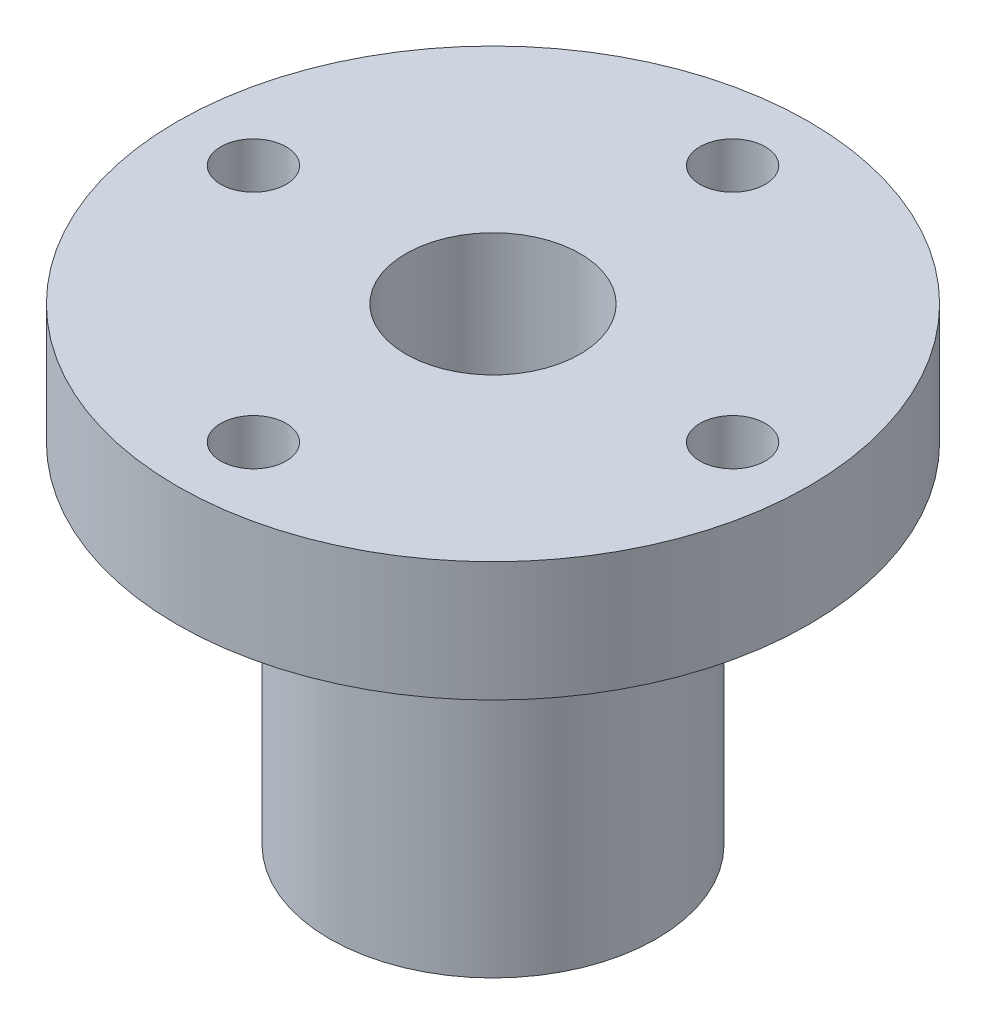
ISO-10303-21;
HEADER;
FILE_DESCRIPTION(('STEP AP214'),'2;1');
FILE_NAME('part.step','',(''),(''),'','','');
FILE_SCHEMA(('AUTOMOTIVE_DESIGN { 1 0 10303 214 1 1 1 1 }'));
ENDSEC;
DATA;
#1=APPLICATION_CONTEXT('core data for automotive mechanical design processes');
#2=APPLICATION_PROTOCOL_DEFINITION('international standard','automotive_design',2000,#1);
#3=PRODUCT_CONTEXT('',#1,'mechanical');
#4=PRODUCT('Part','Part','',(#3));
#5=PRODUCT_RELATED_PRODUCT_CATEGORY('part','',(#4));
#6=PRODUCT_DEFINITION_FORMATION('','',#4);
#7=PRODUCT_DEFINITION_CONTEXT('part definition',#1,'design');
#8=PRODUCT_DEFINITION('design','',#6,#7);
#9=PRODUCT_DEFINITION_SHAPE('','',#8);
#10=(LENGTH_UNIT() NAMED_UNIT(*) SI_UNIT(.MILLI.,.METRE.));
#11=(NAMED_UNIT(*) PLANE_ANGLE_UNIT() SI_UNIT($,.RADIAN.));
#12=(NAMED_UNIT(*) SI_UNIT($,.STERADIAN.) SOLID_ANGLE_UNIT());
#13=UNCERTAINTY_MEASURE_WITH_UNIT(LENGTH_MEASURE(1.E-05),#10,'distance_accuracy_value','');
#14=(GEOMETRIC_REPRESENTATION_CONTEXT(3) GLOBAL_UNCERTAINTY_ASSIGNED_CONTEXT((#13)) GLOBAL_UNIT_ASSIGNED_CONTEXT((#10,
#11,#12)) REPRESENTATION_CONTEXT('',''));
#15=CARTESIAN_POINT('',(0.,0.,0.));
#16=DIRECTION('',(0.,0.,1.));
#17=DIRECTION('',(1.,0.,0.));
#18=AXIS2_PLACEMENT_3D('',#15,#16,#17);
#19=CARTESIAN_POINT('',(0.,16.,0.));
#20=DIRECTION('',(0.,-1.,0.));
#21=DIRECTION('',(0.,0.,-1.));
#22=AXIS2_PLACEMENT_3D('',#19,#20,#21);
#23=CYLINDRICAL_SURFACE('',#22,7.5);
#24=CARTESIAN_POINT('',(0.,0.,0.));
#25=DIRECTION('',(0.,1.,0.));
#26=DIRECTION('',(0.,0.,1.));
#27=AXIS2_PLACEMENT_3D('',#24,#25,#26);
#28=CIRCLE('',#27,7.5);
#29=CARTESIAN_POINT('',(0.,0.,7.5));
#30=VERTEX_POINT('',#29);
#31=EDGE_CURVE('E49',#30,#30,#28,.T.);
#32=ORIENTED_EDGE('',*,*,#31,.T.);
#33=EDGE_LOOP('',(#32));
#34=FACE_BOUND('',#33,.T.);
#35=CARTESIAN_POINT('',(0.,16.,0.));
#36=DIRECTION('',(0.,1.,0.));
#37=DIRECTION('',(0.,0.,1.));
#38=AXIS2_PLACEMENT_3D('',#35,#36,#37);
#39=CIRCLE('',#38,7.5);
#40=CARTESIAN_POINT('',(0.,16.,7.5));
#41=VERTEX_POINT('',#40);
#42=EDGE_CURVE('E10',#41,#41,#39,.T.);
#43=ORIENTED_EDGE('',*,*,#42,.F.);
#44=EDGE_LOOP('',(#43));
#45=FACE_BOUND('',#44,.T.);
#46=ADVANCED_FACE('F43',(#34,#45),#23,.T.);
#47=CARTESIAN_POINT('',(0.,0.,0.));
#48=DIRECTION('',(0.,1.,0.));
#49=DIRECTION('',(0.,0.,1.));
#50=AXIS2_PLACEMENT_3D('',#47,#48,#49);
#51=PLANE('',#50);
#52=ORIENTED_EDGE('',*,*,#31,.F.);
#53=EDGE_LOOP('',(#52));
#54=FACE_BOUND('',#53,.T.);
#55=CARTESIAN_POINT('',(0.,0.,0.));
#56=DIRECTION('',(0.,1.,0.));
#57=DIRECTION('',(0.,0.,1.));
#58=AXIS2_PLACEMENT_3D('',#55,#56,#57);
#59=CIRCLE('',#58,4.);
#60=CARTESIAN_POINT('',(0.,0.,4.));
#61=VERTEX_POINT('',#60);
#62=EDGE_CURVE('E53',#61,#61,#59,.T.);
#63=ORIENTED_EDGE('',*,*,#62,.T.);
#64=EDGE_LOOP('',(#63));
#65=FACE_BOUND('',#64,.T.);
#66=ADVANCED_FACE('F134',(#54,#65),#51,.F.);
#67=CARTESIAN_POINT('',(0.,16.,0.));
#68=DIRECTION('',(0.,-1.,0.));
#69=DIRECTION('',(0.,0.,-1.));
#70=AXIS2_PLACEMENT_3D('',#67,#68,#69);
#71=CYLINDRICAL_SURFACE('',#70,4.);
#72=ORIENTED_EDGE('',*,*,#62,.F.);
#73=EDGE_LOOP('',(#72));
#74=FACE_BOUND('',#73,.T.);
#75=CARTESIAN_POINT('',(0.,21.5,0.));
#76=DIRECTION('',(0.,1.,0.));
#77=DIRECTION('',(0.,0.,1.));
#78=AXIS2_PLACEMENT_3D('',#75,#76,#77);
#79=CIRCLE('',#78,4.);
#80=CARTESIAN_POINT('',(0.,21.5,4.));
#81=VERTEX_POINT('',#80);
#82=EDGE_CURVE('E57',#81,#81,#79,.T.);
#83=ORIENTED_EDGE('',*,*,#82,.T.);
#84=EDGE_LOOP('',(#83));
#85=FACE_BOUND('',#84,.T.);
#86=ADVANCED_FACE('F107',(#74,#85),#71,.F.);
#87=CARTESIAN_POINT('',(0.,21.5,0.));
#88=DIRECTION('',(0.,1.,0.));
#89=DIRECTION('',(0.,0.,1.));
#90=AXIS2_PLACEMENT_3D('',#87,#88,#89);
#91=PLANE('',#90);
#92=CARTESIAN_POINT('',(11.0000000000003,21.5,-3.10618136515851E-13));
#93=DIRECTION('',(0.,1.,0.));
#94=DIRECTION('',(0.,0.,1.));
#95=AXIS2_PLACEMENT_3D('',#92,#93,#94);
#96=CIRCLE('',#95,1.50000000000024);
#97=CARTESIAN_POINT('',(11.0000000000003,21.5,1.49999999999993));
#98=VERTEX_POINT('',#97);
#99=EDGE_CURVE('E87',#98,#98,#96,.T.);
#100=ORIENTED_EDGE('',*,*,#99,.F.);
#101=EDGE_LOOP('',(#100));
#102=FACE_BOUND('',#101,.T.);
#103=CARTESIAN_POINT('',(0.,21.5,11.));
#104=DIRECTION('',(0.,1.,0.));
#105=DIRECTION('',(0.,0.,1.));
#106=AXIS2_PLACEMENT_3D('',#103,#104,#105);
#107=CIRCLE('',#106,1.5);
#108=CARTESIAN_POINT('',(0.,21.5,12.5));
#109=VERTEX_POINT('',#108);
#110=EDGE_CURVE('E81',#109,#109,#107,.T.);
#111=ORIENTED_EDGE('',*,*,#110,.F.);
#112=EDGE_LOOP('',(#111));
#113=FACE_BOUND('',#112,.T.);
#114=CARTESIAN_POINT('',(-10.9999999999997,21.5,3.11965247994913E-13));
#115=DIRECTION('',(0.,1.,0.));
#116=DIRECTION('',(0.,0.,1.));
#117=AXIS2_PLACEMENT_3D('',#114,#115,#116);
#118=CIRCLE('',#117,1.5000000000005);
#119=CARTESIAN_POINT('',(-10.9999999999997,21.5,1.50000000000081));
#120=VERTEX_POINT('',#119);
#121=EDGE_CURVE('E75',#120,#120,#118,.T.);
#122=ORIENTED_EDGE('',*,*,#121,.F.);
#123=EDGE_LOOP('',(#122));
#124=FACE_BOUND('',#123,.T.);
#125=CARTESIAN_POINT('',(0.,21.5,-11.));
#126=DIRECTION('',(0.,1.,0.));
#127=DIRECTION('',(0.,0.,1.));
#128=AXIS2_PLACEMENT_3D('',#125,#126,#127);
#129=CIRCLE('',#128,1.5);
#130=CARTESIAN_POINT('',(0.,21.5,-9.5));
#131=VERTEX_POINT('',#130);
#132=EDGE_CURVE('E69',#131,#131,#129,.T.);
#133=ORIENTED_EDGE('',*,*,#132,.F.);
#134=EDGE_LOOP('',(#133));
#135=FACE_BOUND('',#134,.T.);
#136=ORIENTED_EDGE('',*,*,#82,.F.);
#137=EDGE_LOOP('',(#136));
#138=FACE_BOUND('',#137,.T.);
#139=CARTESIAN_POINT('',(0.,21.5,0.));
#140=DIRECTION('',(0.,1.,0.));
#141=DIRECTION('',(0.,0.,1.));
#142=AXIS2_PLACEMENT_3D('',#139,#140,#141);
#143=CIRCLE('',#142,14.5);
#144=CARTESIAN_POINT('',(0.,21.5,14.5));
#145=VERTEX_POINT('',#144);
#146=EDGE_CURVE('E62',#145,#145,#143,.T.);
#147=ORIENTED_EDGE('',*,*,#146,.T.);
#148=EDGE_LOOP('',(#147));
#149=FACE_BOUND('',#148,.T.);
#150=ADVANCED_FACE('F103',(#102,#113,#124,#135,#138,#149),#91,.T.);
#151=CARTESIAN_POINT('',(0.,21.5,0.));
#152=DIRECTION('',(0.,-1.,0.));
#153=DIRECTION('',(0.,0.,-1.));
#154=AXIS2_PLACEMENT_3D('',#151,#152,#153);
#155=CYLINDRICAL_SURFACE('',#154,14.5);
#156=ORIENTED_EDGE('',*,*,#146,.F.);
#157=EDGE_LOOP('',(#156));
#158=FACE_BOUND('',#157,.T.);
#159=CARTESIAN_POINT('',(0.,16.,0.));
#160=DIRECTION('',(0.,1.,0.));
#161=DIRECTION('',(0.,0.,1.));
#162=AXIS2_PLACEMENT_3D('',#159,#160,#161);
#163=CIRCLE('',#162,14.5);
#164=CARTESIAN_POINT('',(0.,16.,14.5));
#165=VERTEX_POINT('',#164);
#166=EDGE_CURVE('E63',#165,#165,#163,.T.);
#167=ORIENTED_EDGE('',*,*,#166,.T.);
#168=EDGE_LOOP('',(#167));
#169=FACE_BOUND('',#168,.T.);
#170=ADVANCED_FACE('F106',(#158,#169),#155,.T.);
#171=CARTESIAN_POINT('',(0.,16.,0.));
#172=DIRECTION('',(0.,1.,0.));
#173=DIRECTION('',(0.,0.,1.));
#174=AXIS2_PLACEMENT_3D('',#171,#172,#173);
#175=PLANE('',#174);
#176=CARTESIAN_POINT('',(11.0000000000003,16.,-3.10618136515851E-13));
#177=DIRECTION('',(0.,1.,0.));
#178=DIRECTION('',(0.,0.,1.));
#179=AXIS2_PLACEMENT_3D('',#176,#177,#178);
#180=CIRCLE('',#179,1.50000000000024);
#181=CARTESIAN_POINT('',(11.0000000000003,16.,1.49999999999993));
#182=VERTEX_POINT('',#181);
#183=EDGE_CURVE('E66',#182,#182,#180,.T.);
#184=ORIENTED_EDGE('',*,*,#183,.T.);
#185=EDGE_LOOP('',(#184));
#186=FACE_BOUND('',#185,.T.);
#187=CARTESIAN_POINT('',(0.,16.,11.));
#188=DIRECTION('',(0.,1.,0.));
#189=DIRECTION('',(0.,0.,1.));
#190=AXIS2_PLACEMENT_3D('',#187,#188,#189);
#191=CIRCLE('',#190,1.5);
#192=CARTESIAN_POINT('',(0.,16.,12.5));
#193=VERTEX_POINT('',#192);
#194=EDGE_CURVE('E84',#193,#193,#191,.T.);
#195=ORIENTED_EDGE('',*,*,#194,.T.);
#196=EDGE_LOOP('',(#195));
#197=FACE_BOUND('',#196,.T.);
#198=CARTESIAN_POINT('',(-10.9999999999997,16.,3.11965247994913E-13));
#199=DIRECTION('',(0.,1.,0.));
#200=DIRECTION('',(0.,0.,1.));
#201=AXIS2_PLACEMENT_3D('',#198,#199,#200);
#202=CIRCLE('',#201,1.5000000000005);
#203=CARTESIAN_POINT('',(-10.9999999999997,16.,1.50000000000081));
#204=VERTEX_POINT('',#203);
#205=EDGE_CURVE('E78',#204,#204,#202,.T.);
#206=ORIENTED_EDGE('',*,*,#205,.T.);
#207=EDGE_LOOP('',(#206));
#208=FACE_BOUND('',#207,.T.);
#209=CARTESIAN_POINT('',(0.,16.,-11.));
#210=DIRECTION('',(0.,1.,0.));
#211=DIRECTION('',(0.,0.,1.));
#212=AXIS2_PLACEMENT_3D('',#209,#210,#211);
#213=CIRCLE('',#212,1.5);
#214=CARTESIAN_POINT('',(0.,16.,-9.5));
#215=VERTEX_POINT('',#214);
#216=EDGE_CURVE('E72',#215,#215,#213,.T.);
#217=ORIENTED_EDGE('',*,*,#216,.T.);
#218=EDGE_LOOP('',(#217));
#219=FACE_BOUND('',#218,.T.);
#220=ORIENTED_EDGE('',*,*,#42,.T.);
#221=EDGE_LOOP('',(#220));
#222=FACE_BOUND('',#221,.T.);
#223=ORIENTED_EDGE('',*,*,#166,.F.);
#224=EDGE_LOOP('',(#223));
#225=FACE_BOUND('',#224,.T.);
#226=ADVANCED_FACE('F93',(#186,#197,#208,#219,#222,#225),#175,.F.);
#227=CARTESIAN_POINT('',(0.,16.,-11.));
#228=DIRECTION('',(0.,1.,0.));
#229=DIRECTION('',(0.,0.,1.));
#230=AXIS2_PLACEMENT_3D('',#227,#228,#229);
#231=CYLINDRICAL_SURFACE('',#230,1.5);
#232=ORIENTED_EDGE('',*,*,#216,.F.);
#233=EDGE_LOOP('',(#232));
#234=FACE_BOUND('',#233,.T.);
#235=ORIENTED_EDGE('',*,*,#132,.T.);
#236=EDGE_LOOP('',(#235));
#237=FACE_BOUND('',#236,.T.);
#238=ADVANCED_FACE('F125',(#234,#237),#231,.F.);
#239=CARTESIAN_POINT('',(-10.9999999999997,16.,3.11965247994913E-13));
#240=DIRECTION('',(0.,1.,0.));
#241=DIRECTION('',(0.,0.,1.));
#242=AXIS2_PLACEMENT_3D('',#239,#240,#241);
#243=CYLINDRICAL_SURFACE('',#242,1.5000000000005);
#244=ORIENTED_EDGE('',*,*,#205,.F.);
#245=EDGE_LOOP('',(#244));
#246=FACE_BOUND('',#245,.T.);
#247=ORIENTED_EDGE('',*,*,#121,.T.);
#248=EDGE_LOOP('',(#247));
#249=FACE_BOUND('',#248,.T.);
#250=ADVANCED_FACE('F130',(#246,#249),#243,.F.);
#251=CARTESIAN_POINT('',(0.,16.,11.));
#252=DIRECTION('',(0.,1.,0.));
#253=DIRECTION('',(0.,0.,1.));
#254=AXIS2_PLACEMENT_3D('',#251,#252,#253);
#255=CYLINDRICAL_SURFACE('',#254,1.5);
#256=ORIENTED_EDGE('',*,*,#194,.F.);
#257=EDGE_LOOP('',(#256));
#258=FACE_BOUND('',#257,.T.);
#259=ORIENTED_EDGE('',*,*,#110,.T.);
#260=EDGE_LOOP('',(#259));
#261=FACE_BOUND('',#260,.T.);
#262=ADVANCED_FACE('F99',(#258,#261),#255,.F.);
#263=CARTESIAN_POINT('',(11.0000000000003,16.,-3.10618136515851E-13));
#264=DIRECTION('',(0.,1.,0.));
#265=DIRECTION('',(0.,0.,1.));
#266=AXIS2_PLACEMENT_3D('',#263,#264,#265);
#267=CYLINDRICAL_SURFACE('',#266,1.50000000000024);
#268=ORIENTED_EDGE('',*,*,#183,.F.);
#269=EDGE_LOOP('',(#268));
#270=FACE_BOUND('',#269,.T.);
#271=ORIENTED_EDGE('',*,*,#99,.T.);
#272=EDGE_LOOP('',(#271));
#273=FACE_BOUND('',#272,.T.);
#274=ADVANCED_FACE('F96',(#270,#273),#267,.F.);
#275=CLOSED_SHELL('',(#46,#66,#86,#150,#170,#226,#238,#250,#262,#274));
#276=MANIFOLD_SOLID_BREP('B2',#275);
#277=ADVANCED_BREP_SHAPE_REPRESENTATION('',(#18,#276),#14);
#278=SHAPE_DEFINITION_REPRESENTATION(#9,#277);
ENDSEC;
END-ISO-10303-21;
